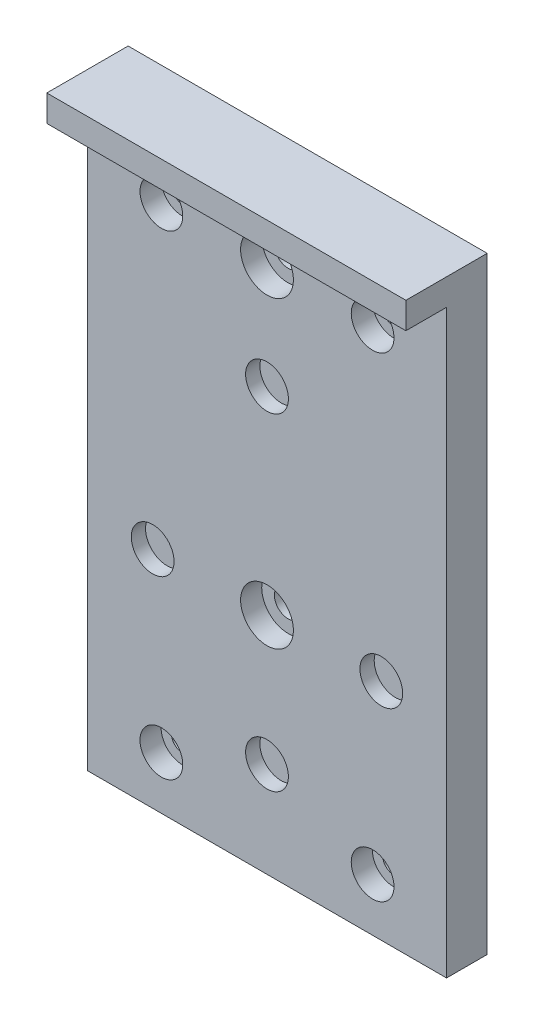
ISO-10303-21;
HEADER;
FILE_DESCRIPTION(('STEP AP214'),'2;1');
FILE_NAME('part.step','',(''),(''),'','','');
FILE_SCHEMA(('AUTOMOTIVE_DESIGN { 1 0 10303 214 1 1 1 1 }'));
ENDSEC;
DATA;
#1=APPLICATION_CONTEXT('core data for automotive mechanical design processes');
#2=APPLICATION_PROTOCOL_DEFINITION('international standard','automotive_design',2000,#1);
#3=PRODUCT_CONTEXT('',#1,'mechanical');
#4=PRODUCT('Part','Part','',(#3));
#5=PRODUCT_RELATED_PRODUCT_CATEGORY('part','',(#4));
#6=PRODUCT_DEFINITION_FORMATION('','',#4);
#7=PRODUCT_DEFINITION_CONTEXT('part definition',#1,'design');
#8=PRODUCT_DEFINITION('design','',#6,#7);
#9=PRODUCT_DEFINITION_SHAPE('','',#8);
#10=(LENGTH_UNIT() NAMED_UNIT(*) SI_UNIT(.MILLI.,.METRE.));
#11=(NAMED_UNIT(*) PLANE_ANGLE_UNIT() SI_UNIT($,.RADIAN.));
#12=(NAMED_UNIT(*) SI_UNIT($,.STERADIAN.) SOLID_ANGLE_UNIT());
#13=UNCERTAINTY_MEASURE_WITH_UNIT(LENGTH_MEASURE(1.E-05),#10,'distance_accuracy_value','');
#14=(GEOMETRIC_REPRESENTATION_CONTEXT(3) GLOBAL_UNCERTAINTY_ASSIGNED_CONTEXT((#13)) GLOBAL_UNIT_ASSIGNED_CONTEXT((#10,
#11,#12)) REPRESENTATION_CONTEXT('',''));
#15=CARTESIAN_POINT('',(0.,0.,0.));
#16=DIRECTION('',(0.,0.,1.));
#17=DIRECTION('',(1.,0.,0.));
#18=AXIS2_PLACEMENT_3D('',#15,#16,#17);
#19=CARTESIAN_POINT('',(0.,-36.95,7.7));
#20=DIRECTION('',(0.,0.,-1.));
#21=DIRECTION('',(-1.,0.,0.));
#22=AXIS2_PLACEMENT_3D('',#19,#20,#21);
#23=CYLINDRICAL_SURFACE('',#22,4.05);
#24=CARTESIAN_POINT('',(0.,-36.95,7.7));
#25=DIRECTION('',(0.,0.,1.));
#26=DIRECTION('',(1.,0.,0.));
#27=AXIS2_PLACEMENT_3D('',#24,#25,#26);
#28=CIRCLE('',#27,4.05);
#29=CARTESIAN_POINT('',(4.05,-36.95,7.7));
#30=VERTEX_POINT('',#29);
#31=EDGE_CURVE('E175',#30,#30,#28,.T.);
#32=ORIENTED_EDGE('',*,*,#31,.T.);
#33=EDGE_LOOP('',(#32));
#34=FACE_BOUND('',#33,.T.);
#35=CARTESIAN_POINT('',(0.,-36.95,5.));
#36=DIRECTION('',(0.,0.,-1.));
#37=DIRECTION('',(-1.,0.,0.));
#38=AXIS2_PLACEMENT_3D('',#35,#36,#37);
#39=CIRCLE('',#38,4.05);
#40=CARTESIAN_POINT('',(-4.05,-36.95,5.));
#41=VERTEX_POINT('',#40);
#42=EDGE_CURVE('E121',#41,#41,#39,.T.);
#43=ORIENTED_EDGE('',*,*,#42,.T.);
#44=EDGE_LOOP('',(#43));
#45=FACE_BOUND('',#44,.T.);
#46=ADVANCED_FACE('F33',(#34,#45),#23,.F.);
#47=CARTESIAN_POINT('',(-21.650635094611,-12.5,7.7));
#48=DIRECTION('',(0.,0.,-1.));
#49=DIRECTION('',(-1.,0.,0.));
#50=AXIS2_PLACEMENT_3D('',#47,#48,#49);
#51=CYLINDRICAL_SURFACE('',#50,4.05);
#52=CARTESIAN_POINT('',(-21.650635094611,-12.5,7.7));
#53=DIRECTION('',(0.,0.,1.));
#54=DIRECTION('',(1.,0.,0.));
#55=AXIS2_PLACEMENT_3D('',#52,#53,#54);
#56=CIRCLE('',#55,4.05);
#57=CARTESIAN_POINT('',(-17.600635094611,-12.5,7.7));
#58=VERTEX_POINT('',#57);
#59=EDGE_CURVE('E172',#58,#58,#56,.T.);
#60=ORIENTED_EDGE('',*,*,#59,.T.);
#61=EDGE_LOOP('',(#60));
#62=FACE_BOUND('',#61,.T.);
#63=CARTESIAN_POINT('',(-21.650635094611,-12.5,5.));
#64=DIRECTION('',(0.,0.,-1.));
#65=DIRECTION('',(-1.,0.,0.));
#66=AXIS2_PLACEMENT_3D('',#63,#64,#65);
#67=CIRCLE('',#66,4.05);
#68=CARTESIAN_POINT('',(-25.700635094611,-12.5,5.));
#69=VERTEX_POINT('',#68);
#70=EDGE_CURVE('E118',#69,#69,#67,.T.);
#71=ORIENTED_EDGE('',*,*,#70,.T.);
#72=EDGE_LOOP('',(#71));
#73=FACE_BOUND('',#72,.T.);
#74=ADVANCED_FACE('F264',(#62,#73),#51,.F.);
#75=CARTESIAN_POINT('',(0.,25.,7.7));
#76=DIRECTION('',(0.,0.,-1.));
#77=DIRECTION('',(-1.,0.,0.));
#78=AXIS2_PLACEMENT_3D('',#75,#76,#77);
#79=CYLINDRICAL_SURFACE('',#78,4.05);
#80=CARTESIAN_POINT('',(0.,25.,7.7));
#81=DIRECTION('',(0.,0.,1.));
#82=DIRECTION('',(1.,0.,0.));
#83=AXIS2_PLACEMENT_3D('',#80,#81,#82);
#84=CIRCLE('',#83,4.05);
#85=CARTESIAN_POINT('',(4.04999999999999,25.,7.7));
#86=VERTEX_POINT('',#85);
#87=EDGE_CURVE('E169',#86,#86,#84,.T.);
#88=ORIENTED_EDGE('',*,*,#87,.T.);
#89=EDGE_LOOP('',(#88));
#90=FACE_BOUND('',#89,.T.);
#91=CARTESIAN_POINT('',(0.,25.,5.));
#92=DIRECTION('',(0.,0.,-1.));
#93=DIRECTION('',(-1.,0.,0.));
#94=AXIS2_PLACEMENT_3D('',#91,#92,#93);
#95=CIRCLE('',#94,4.05);
#96=CARTESIAN_POINT('',(-4.05000000000001,25.,5.));
#97=VERTEX_POINT('',#96);
#98=EDGE_CURVE('E115',#97,#97,#95,.T.);
#99=ORIENTED_EDGE('',*,*,#98,.T.);
#100=EDGE_LOOP('',(#99));
#101=FACE_BOUND('',#100,.T.);
#102=ADVANCED_FACE('F270',(#90,#101),#79,.F.);
#103=CARTESIAN_POINT('',(21.650635094611,-12.5,7.7));
#104=DIRECTION('',(0.,0.,-1.));
#105=DIRECTION('',(-1.,0.,0.));
#106=AXIS2_PLACEMENT_3D('',#103,#104,#105);
#107=CYLINDRICAL_SURFACE('',#106,4.05);
#108=CARTESIAN_POINT('',(21.650635094611,-12.5,7.7));
#109=DIRECTION('',(0.,0.,1.));
#110=DIRECTION('',(1.,0.,0.));
#111=AXIS2_PLACEMENT_3D('',#108,#109,#110);
#112=CIRCLE('',#111,4.05);
#113=CARTESIAN_POINT('',(25.700635094611,-12.5,7.7));
#114=VERTEX_POINT('',#113);
#115=EDGE_CURVE('E166',#114,#114,#112,.T.);
#116=ORIENTED_EDGE('',*,*,#115,.T.);
#117=EDGE_LOOP('',(#116));
#118=FACE_BOUND('',#117,.T.);
#119=CARTESIAN_POINT('',(21.650635094611,-12.5,5.));
#120=DIRECTION('',(0.,0.,-1.));
#121=DIRECTION('',(-1.,0.,0.));
#122=AXIS2_PLACEMENT_3D('',#119,#120,#121);
#123=CIRCLE('',#122,4.05);
#124=CARTESIAN_POINT('',(17.600635094611,-12.5,5.));
#125=VERTEX_POINT('',#124);
#126=EDGE_CURVE('E111',#125,#125,#123,.T.);
#127=ORIENTED_EDGE('',*,*,#126,.T.);
#128=EDGE_LOOP('',(#127));
#129=FACE_BOUND('',#128,.T.);
#130=ADVANCED_FACE('F280',(#118,#129),#107,.F.);
#131=CARTESIAN_POINT('',(0.,0.,7.7));
#132=DIRECTION('',(0.,0.,1.));
#133=DIRECTION('',(1.,0.,0.));
#134=AXIS2_PLACEMENT_3D('',#131,#132,#133);
#135=PLANE('',#134);
#136=CARTESIAN_POINT('',(0.,45.,7.7));
#137=DIRECTION('',(0.,0.,-1.));
#138=DIRECTION('',(-1.,0.,0.));
#139=AXIS2_PLACEMENT_3D('',#136,#137,#138);
#140=CIRCLE('',#139,5.);
#141=CARTESIAN_POINT('',(-5.00000000000001,45.,7.7));
#142=VERTEX_POINT('',#141);
#143=EDGE_CURVE('E201',#142,#142,#140,.T.);
#144=ORIENTED_EDGE('',*,*,#143,.T.);
#145=EDGE_LOOP('',(#144));
#146=FACE_BOUND('',#145,.T.);
#147=CARTESIAN_POINT('',(-20.,-45.,7.7));
#148=DIRECTION('',(0.,0.,-1.));
#149=DIRECTION('',(-1.,0.,0.));
#150=AXIS2_PLACEMENT_3D('',#147,#148,#149);
#151=CIRCLE('',#150,4.05);
#152=CARTESIAN_POINT('',(-24.05,-45.,7.7));
#153=VERTEX_POINT('',#152);
#154=EDGE_CURVE('E208',#153,#153,#151,.T.);
#155=ORIENTED_EDGE('',*,*,#154,.T.);
#156=EDGE_LOOP('',(#155));
#157=FACE_BOUND('',#156,.T.);
#158=CARTESIAN_POINT('',(20.,-45.,7.7));
#159=DIRECTION('',(0.,0.,-1.));
#160=DIRECTION('',(-1.,0.,0.));
#161=AXIS2_PLACEMENT_3D('',#158,#159,#160);
#162=CIRCLE('',#161,4.05);
#163=CARTESIAN_POINT('',(15.95,-45.,7.7));
#164=VERTEX_POINT('',#163);
#165=EDGE_CURVE('E189',#164,#164,#162,.T.);
#166=ORIENTED_EDGE('',*,*,#165,.T.);
#167=EDGE_LOOP('',(#166));
#168=FACE_BOUND('',#167,.T.);
#169=CARTESIAN_POINT('',(-20.,45.,7.7));
#170=DIRECTION('',(0.,0.,-1.));
#171=DIRECTION('',(-1.,0.,0.));
#172=AXIS2_PLACEMENT_3D('',#169,#170,#171);
#173=CIRCLE('',#172,4.05);
#174=CARTESIAN_POINT('',(-24.05,45.,7.7));
#175=VERTEX_POINT('',#174);
#176=EDGE_CURVE('E196',#175,#175,#173,.T.);
#177=ORIENTED_EDGE('',*,*,#176,.T.);
#178=EDGE_LOOP('',(#177));
#179=FACE_BOUND('',#178,.T.);
#180=CARTESIAN_POINT('',(0.,-12.5,7.7));
#181=DIRECTION('',(0.,0.,-1.));
#182=DIRECTION('',(-1.,0.,0.));
#183=AXIS2_PLACEMENT_3D('',#180,#181,#182);
#184=CIRCLE('',#183,5.);
#185=CARTESIAN_POINT('',(-5.00000000000001,-12.5,7.7));
#186=VERTEX_POINT('',#185);
#187=EDGE_CURVE('E213',#186,#186,#184,.T.);
#188=ORIENTED_EDGE('',*,*,#187,.T.);
#189=EDGE_LOOP('',(#188));
#190=FACE_BOUND('',#189,.T.);
#191=CARTESIAN_POINT('',(20.,45.,7.7));
#192=DIRECTION('',(0.,0.,-1.));
#193=DIRECTION('',(-1.,0.,0.));
#194=AXIS2_PLACEMENT_3D('',#191,#192,#193);
#195=CIRCLE('',#194,4.05);
#196=CARTESIAN_POINT('',(15.95,45.,7.7));
#197=VERTEX_POINT('',#196);
#198=EDGE_CURVE('E183',#197,#197,#195,.T.);
#199=ORIENTED_EDGE('',*,*,#198,.T.);
#200=EDGE_LOOP('',(#199));
#201=FACE_BOUND('',#200,.T.);
#202=ORIENTED_EDGE('',*,*,#59,.F.);
#203=EDGE_LOOP('',(#202));
#204=FACE_BOUND('',#203,.T.);
#205=ORIENTED_EDGE('',*,*,#115,.F.);
#206=EDGE_LOOP('',(#205));
#207=FACE_BOUND('',#206,.T.);
#208=DIRECTION('',(0.,1.,0.));
#209=VECTOR('',#208,1.);
#210=CARTESIAN_POINT('',(34.,55.,7.7));
#211=LINE('',#210,#209);
#212=CARTESIAN_POINT('',(34.,-55.,7.7));
#213=VERTEX_POINT('',#212);
#214=CARTESIAN_POINT('',(34.,55.,7.7));
#215=VERTEX_POINT('',#214);
#216=EDGE_CURVE('E95',#213,#215,#211,.T.);
#217=ORIENTED_EDGE('',*,*,#216,.T.);
#218=DIRECTION('',(-1.,0.,0.));
#219=VECTOR('',#218,1.);
#220=CARTESIAN_POINT('',(-34.,55.,7.7));
#221=LINE('',#220,#219);
#222=CARTESIAN_POINT('',(-34.,55.,7.7));
#223=VERTEX_POINT('',#222);
#224=EDGE_CURVE('E73',#215,#223,#221,.T.);
#225=ORIENTED_EDGE('',*,*,#224,.T.);
#226=DIRECTION('',(0.,-1.,0.));
#227=VECTOR('',#226,1.);
#228=CARTESIAN_POINT('',(-34.,55.,7.7));
#229=LINE('',#228,#227);
#230=CARTESIAN_POINT('',(-34.,-55.,7.7));
#231=VERTEX_POINT('',#230);
#232=EDGE_CURVE('E93',#223,#231,#229,.T.);
#233=ORIENTED_EDGE('',*,*,#232,.T.);
#234=DIRECTION('',(1.,0.,0.));
#235=VECTOR('',#234,1.);
#236=CARTESIAN_POINT('',(-34.,-55.,7.7));
#237=LINE('',#236,#235);
#238=EDGE_CURVE('E52',#231,#213,#237,.T.);
#239=ORIENTED_EDGE('',*,*,#238,.T.);
#240=EDGE_LOOP('',(#217,#225,#233,#239));
#241=FACE_BOUND('',#240,.T.);
#242=ORIENTED_EDGE('',*,*,#87,.F.);
#243=EDGE_LOOP('',(#242));
#244=FACE_BOUND('',#243,.T.);
#245=ORIENTED_EDGE('',*,*,#31,.F.);
#246=EDGE_LOOP('',(#245));
#247=FACE_BOUND('',#246,.T.);
#248=ADVANCED_FACE('F91',(#146,#157,#168,#179,#190,#201,#204,#207,#241,#244,#247),#135,.T.);
#249=CARTESIAN_POINT('',(0.,0.,0.));
#250=DIRECTION('',(0.,0.,1.));
#251=DIRECTION('',(1.,0.,0.));
#252=AXIS2_PLACEMENT_3D('',#249,#250,#251);
#253=PLANE('',#252);
#254=DIRECTION('',(0.,1.,0.));
#255=VECTOR('',#254,1.);
#256=CARTESIAN_POINT('',(34.,55.,0.));
#257=LINE('',#256,#255);
#258=CARTESIAN_POINT('',(34.,-55.,0.));
#259=VERTEX_POINT('',#258);
#260=CARTESIAN_POINT('',(34.,60.,0.));
#261=VERTEX_POINT('',#260);
#262=EDGE_CURVE('E102',#259,#261,#257,.T.);
#263=ORIENTED_EDGE('',*,*,#262,.F.);
#264=DIRECTION('',(1.,0.,0.));
#265=VECTOR('',#264,1.);
#266=CARTESIAN_POINT('',(-34.,-55.,0.));
#267=LINE('',#266,#265);
#268=CARTESIAN_POINT('',(-34.,-55.,0.));
#269=VERTEX_POINT('',#268);
#270=EDGE_CURVE('E107',#269,#259,#267,.T.);
#271=ORIENTED_EDGE('',*,*,#270,.F.);
#272=DIRECTION('',(0.,-1.,0.));
#273=VECTOR('',#272,1.);
#274=CARTESIAN_POINT('',(-34.,55.,0.));
#275=LINE('',#274,#273);
#276=CARTESIAN_POINT('',(-34.,60.,0.));
#277=VERTEX_POINT('',#276);
#278=EDGE_CURVE('E64',#277,#269,#275,.T.);
#279=ORIENTED_EDGE('',*,*,#278,.F.);
#280=DIRECTION('',(-1.,0.,0.));
#281=VECTOR('',#280,1.);
#282=CARTESIAN_POINT('',(34.,60.,0.));
#283=LINE('',#282,#281);
#284=EDGE_CURVE('E89',#261,#277,#283,.T.);
#285=ORIENTED_EDGE('',*,*,#284,.F.);
#286=EDGE_LOOP('',(#263,#271,#279,#285));
#287=FACE_BOUND('',#286,.T.);
#288=CARTESIAN_POINT('',(20.,45.,0.));
#289=DIRECTION('',(0.,0.,1.));
#290=DIRECTION('',(1.,0.,0.));
#291=AXIS2_PLACEMENT_3D('',#288,#289,#290);
#292=CIRCLE('',#291,2.1);
#293=CARTESIAN_POINT('',(22.1,45.,0.));
#294=VERTEX_POINT('',#293);
#295=EDGE_CURVE('E105',#294,#294,#292,.T.);
#296=ORIENTED_EDGE('',*,*,#295,.T.);
#297=EDGE_LOOP('',(#296));
#298=FACE_BOUND('',#297,.T.);
#299=CARTESIAN_POINT('',(-20.,45.,0.));
#300=DIRECTION('',(0.,0.,1.));
#301=DIRECTION('',(1.,0.,0.));
#302=AXIS2_PLACEMENT_3D('',#299,#300,#301);
#303=CIRCLE('',#302,2.1);
#304=CARTESIAN_POINT('',(-17.9,45.,0.));
#305=VERTEX_POINT('',#304);
#306=EDGE_CURVE('E155',#305,#305,#303,.T.);
#307=ORIENTED_EDGE('',*,*,#306,.T.);
#308=EDGE_LOOP('',(#307));
#309=FACE_BOUND('',#308,.T.);
#310=CARTESIAN_POINT('',(20.,-45.,0.));
#311=DIRECTION('',(0.,0.,1.));
#312=DIRECTION('',(1.,0.,0.));
#313=AXIS2_PLACEMENT_3D('',#310,#311,#312);
#314=CIRCLE('',#313,2.1);
#315=CARTESIAN_POINT('',(22.1,-45.,0.));
#316=VERTEX_POINT('',#315);
#317=EDGE_CURVE('E158',#316,#316,#314,.T.);
#318=ORIENTED_EDGE('',*,*,#317,.T.);
#319=EDGE_LOOP('',(#318));
#320=FACE_BOUND('',#319,.T.);
#321=CARTESIAN_POINT('',(-20.,-45.,0.));
#322=DIRECTION('',(0.,0.,1.));
#323=DIRECTION('',(1.,0.,0.));
#324=AXIS2_PLACEMENT_3D('',#321,#322,#323);
#325=CIRCLE('',#324,2.1);
#326=CARTESIAN_POINT('',(-17.9,-45.,0.));
#327=VERTEX_POINT('',#326);
#328=EDGE_CURVE('E163',#327,#327,#325,.T.);
#329=ORIENTED_EDGE('',*,*,#328,.T.);
#330=EDGE_LOOP('',(#329));
#331=FACE_BOUND('',#330,.T.);
#332=CARTESIAN_POINT('',(0.,45.,0.));
#333=DIRECTION('',(0.,0.,1.));
#334=DIRECTION('',(1.,0.,0.));
#335=AXIS2_PLACEMENT_3D('',#332,#333,#334);
#336=CIRCLE('',#335,2.6);
#337=CARTESIAN_POINT('',(2.59999999999999,45.,0.));
#338=VERTEX_POINT('',#337);
#339=EDGE_CURVE('E178',#338,#338,#336,.T.);
#340=ORIENTED_EDGE('',*,*,#339,.T.);
#341=EDGE_LOOP('',(#340));
#342=FACE_BOUND('',#341,.T.);
#343=CARTESIAN_POINT('',(0.,-12.5,0.));
#344=DIRECTION('',(0.,0.,1.));
#345=DIRECTION('',(1.,0.,0.));
#346=AXIS2_PLACEMENT_3D('',#343,#344,#345);
#347=CIRCLE('',#346,2.6);
#348=CARTESIAN_POINT('',(2.59999999999999,-12.5,0.));
#349=VERTEX_POINT('',#348);
#350=EDGE_CURVE('E114',#349,#349,#347,.T.);
#351=ORIENTED_EDGE('',*,*,#350,.T.);
#352=EDGE_LOOP('',(#351));
#353=FACE_BOUND('',#352,.T.);
#354=ADVANCED_FACE('F253',(#287,#298,#309,#320,#331,#342,#353),#253,.F.);
#355=CARTESIAN_POINT('',(34.,55.,7.7));
#356=DIRECTION('',(-1.,0.,0.));
#357=DIRECTION('',(0.,-1.,0.));
#358=AXIS2_PLACEMENT_3D('',#355,#356,#357);
#359=PLANE('',#358);
#360=ORIENTED_EDGE('',*,*,#262,.T.);
#361=DIRECTION('',(0.,0.,1.));
#362=VECTOR('',#361,1.);
#363=CARTESIAN_POINT('',(34.,60.,0.));
#364=LINE('',#363,#362);
#365=CARTESIAN_POINT('',(34.,60.,15.4));
#366=VERTEX_POINT('',#365);
#367=EDGE_CURVE('E220',#261,#366,#364,.T.);
#368=ORIENTED_EDGE('',*,*,#367,.T.);
#369=DIRECTION('',(0.,1.,0.));
#370=VECTOR('',#369,1.);
#371=CARTESIAN_POINT('',(34.,55.,15.4));
#372=LINE('',#371,#370);
#373=CARTESIAN_POINT('',(34.,55.,15.4));
#374=VERTEX_POINT('',#373);
#375=EDGE_CURVE('E230',#374,#366,#372,.T.);
#376=ORIENTED_EDGE('',*,*,#375,.F.);
#377=DIRECTION('',(0.,0.,1.));
#378=VECTOR('',#377,1.);
#379=CARTESIAN_POINT('',(34.,55.,0.));
#380=LINE('',#379,#378);
#381=EDGE_CURVE('E88',#215,#374,#380,.T.);
#382=ORIENTED_EDGE('',*,*,#381,.F.);
#383=ORIENTED_EDGE('',*,*,#216,.F.);
#384=DIRECTION('',(0.,0.,-1.));
#385=VECTOR('',#384,1.);
#386=CARTESIAN_POINT('',(34.,-55.,7.7));
#387=LINE('',#386,#385);
#388=EDGE_CURVE('E43',#213,#259,#387,.T.);
#389=ORIENTED_EDGE('',*,*,#388,.T.);
#390=EDGE_LOOP('',(#360,#368,#376,#382,#383,#389));
#391=FACE_BOUND('',#390,.T.);
#392=ADVANCED_FACE('F35',(#391),#359,.F.);
#393=CARTESIAN_POINT('',(-34.,55.,7.7));
#394=DIRECTION('',(1.,0.,0.));
#395=DIRECTION('',(0.,1.,0.));
#396=AXIS2_PLACEMENT_3D('',#393,#394,#395);
#397=PLANE('',#396);
#398=ORIENTED_EDGE('',*,*,#278,.T.);
#399=DIRECTION('',(0.,0.,-1.));
#400=VECTOR('',#399,1.);
#401=CARTESIAN_POINT('',(-34.,-55.,7.7));
#402=LINE('',#401,#400);
#403=EDGE_CURVE('E11',#231,#269,#402,.T.);
#404=ORIENTED_EDGE('',*,*,#403,.F.);
#405=ORIENTED_EDGE('',*,*,#232,.F.);
#406=DIRECTION('',(0.,0.,1.));
#407=VECTOR('',#406,1.);
#408=CARTESIAN_POINT('',(-34.,55.,0.));
#409=LINE('',#408,#407);
#410=CARTESIAN_POINT('',(-34.,55.,15.4));
#411=VERTEX_POINT('',#410);
#412=EDGE_CURVE('E80',#223,#411,#409,.T.);
#413=ORIENTED_EDGE('',*,*,#412,.T.);
#414=DIRECTION('',(0.,-1.,0.));
#415=VECTOR('',#414,1.);
#416=CARTESIAN_POINT('',(-34.,60.,15.4));
#417=LINE('',#416,#415);
#418=CARTESIAN_POINT('',(-34.,60.,15.4));
#419=VERTEX_POINT('',#418);
#420=EDGE_CURVE('E234',#419,#411,#417,.T.);
#421=ORIENTED_EDGE('',*,*,#420,.F.);
#422=DIRECTION('',(0.,0.,1.));
#423=VECTOR('',#422,1.);
#424=CARTESIAN_POINT('',(-34.,60.,0.));
#425=LINE('',#424,#423);
#426=EDGE_CURVE('E216',#277,#419,#425,.T.);
#427=ORIENTED_EDGE('',*,*,#426,.F.);
#428=EDGE_LOOP('',(#398,#404,#405,#413,#421,#427));
#429=FACE_BOUND('',#428,.T.);
#430=ADVANCED_FACE('F97',(#429),#397,.F.);
#431=CARTESIAN_POINT('',(-34.,-55.,7.7));
#432=DIRECTION('',(0.,1.,0.));
#433=DIRECTION('',(0.,0.,1.));
#434=AXIS2_PLACEMENT_3D('',#431,#432,#433);
#435=PLANE('',#434);
#436=ORIENTED_EDGE('',*,*,#270,.T.);
#437=ORIENTED_EDGE('',*,*,#388,.F.);
#438=ORIENTED_EDGE('',*,*,#238,.F.);
#439=ORIENTED_EDGE('',*,*,#403,.T.);
#440=EDGE_LOOP('',(#436,#437,#438,#439));
#441=FACE_BOUND('',#440,.T.);
#442=ADVANCED_FACE('F150',(#441),#435,.F.);
#443=CARTESIAN_POINT('',(20.,45.,7.7));
#444=DIRECTION('',(0.,0.,-1.));
#445=DIRECTION('',(-1.,0.,0.));
#446=AXIS2_PLACEMENT_3D('',#443,#444,#445);
#447=CYLINDRICAL_SURFACE('',#446,2.1);
#448=CARTESIAN_POINT('',(20.,45.,3.7));
#449=DIRECTION('',(0.,0.,-1.));
#450=DIRECTION('',(-1.,0.,0.));
#451=AXIS2_PLACEMENT_3D('',#448,#449,#450);
#452=CIRCLE('',#451,2.1);
#453=CARTESIAN_POINT('',(17.9,45.,3.7));
#454=VERTEX_POINT('',#453);
#455=EDGE_CURVE('E37',#454,#454,#452,.T.);
#456=ORIENTED_EDGE('',*,*,#455,.F.);
#457=EDGE_LOOP('',(#456));
#458=FACE_BOUND('',#457,.T.);
#459=ORIENTED_EDGE('',*,*,#295,.F.);
#460=EDGE_LOOP('',(#459));
#461=FACE_BOUND('',#460,.T.);
#462=ADVANCED_FACE('F146',(#458,#461),#447,.F.);
#463=CARTESIAN_POINT('',(-20.,45.,7.7));
#464=DIRECTION('',(0.,0.,-1.));
#465=DIRECTION('',(-1.,0.,0.));
#466=AXIS2_PLACEMENT_3D('',#463,#464,#465);
#467=CYLINDRICAL_SURFACE('',#466,2.1);
#468=CARTESIAN_POINT('',(-20.,45.,3.7));
#469=DIRECTION('',(0.,0.,-1.));
#470=DIRECTION('',(-1.,0.,0.));
#471=AXIS2_PLACEMENT_3D('',#468,#469,#470);
#472=CIRCLE('',#471,2.1);
#473=CARTESIAN_POINT('',(-22.1,45.,3.7));
#474=VERTEX_POINT('',#473);
#475=EDGE_CURVE('E136',#474,#474,#472,.T.);
#476=ORIENTED_EDGE('',*,*,#475,.F.);
#477=EDGE_LOOP('',(#476));
#478=FACE_BOUND('',#477,.T.);
#479=ORIENTED_EDGE('',*,*,#306,.F.);
#480=EDGE_LOOP('',(#479));
#481=FACE_BOUND('',#480,.T.);
#482=ADVANCED_FACE('F149',(#478,#481),#467,.F.);
#483=CARTESIAN_POINT('',(20.,-45.,7.7));
#484=DIRECTION('',(0.,0.,-1.));
#485=DIRECTION('',(-1.,0.,0.));
#486=AXIS2_PLACEMENT_3D('',#483,#484,#485);
#487=CYLINDRICAL_SURFACE('',#486,2.1);
#488=CARTESIAN_POINT('',(20.,-45.,3.7));
#489=DIRECTION('',(0.,0.,-1.));
#490=DIRECTION('',(-1.,0.,0.));
#491=AXIS2_PLACEMENT_3D('',#488,#489,#490);
#492=CIRCLE('',#491,2.1);
#493=CARTESIAN_POINT('',(17.9,-45.,3.7));
#494=VERTEX_POINT('',#493);
#495=EDGE_CURVE('E134',#494,#494,#492,.T.);
#496=ORIENTED_EDGE('',*,*,#495,.F.);
#497=EDGE_LOOP('',(#496));
#498=FACE_BOUND('',#497,.T.);
#499=ORIENTED_EDGE('',*,*,#317,.F.);
#500=EDGE_LOOP('',(#499));
#501=FACE_BOUND('',#500,.T.);
#502=ADVANCED_FACE('F288',(#498,#501),#487,.F.);
#503=CARTESIAN_POINT('',(-20.,-45.,7.7));
#504=DIRECTION('',(0.,0.,-1.));
#505=DIRECTION('',(-1.,0.,0.));
#506=AXIS2_PLACEMENT_3D('',#503,#504,#505);
#507=CYLINDRICAL_SURFACE('',#506,2.1);
#508=CARTESIAN_POINT('',(-20.,-45.,3.7));
#509=DIRECTION('',(0.,0.,-1.));
#510=DIRECTION('',(-1.,0.,0.));
#511=AXIS2_PLACEMENT_3D('',#508,#509,#510);
#512=CIRCLE('',#511,2.1);
#513=CARTESIAN_POINT('',(-22.1,-45.,3.7));
#514=VERTEX_POINT('',#513);
#515=EDGE_CURVE('E131',#514,#514,#512,.T.);
#516=ORIENTED_EDGE('',*,*,#515,.F.);
#517=EDGE_LOOP('',(#516));
#518=FACE_BOUND('',#517,.T.);
#519=ORIENTED_EDGE('',*,*,#328,.F.);
#520=EDGE_LOOP('',(#519));
#521=FACE_BOUND('',#520,.T.);
#522=ADVANCED_FACE('F285',(#518,#521),#507,.F.);
#523=CARTESIAN_POINT('',(0.,45.,7.7));
#524=DIRECTION('',(0.,0.,-1.));
#525=DIRECTION('',(-1.,0.,0.));
#526=AXIS2_PLACEMENT_3D('',#523,#524,#525);
#527=CYLINDRICAL_SURFACE('',#526,2.6);
#528=CARTESIAN_POINT('',(0.,45.,3.7));
#529=DIRECTION('',(0.,0.,-1.));
#530=DIRECTION('',(-1.,0.,0.));
#531=AXIS2_PLACEMENT_3D('',#528,#529,#530);
#532=CIRCLE('',#531,2.6);
#533=CARTESIAN_POINT('',(-2.60000000000001,45.,3.7));
#534=VERTEX_POINT('',#533);
#535=EDGE_CURVE('E127',#534,#534,#532,.T.);
#536=ORIENTED_EDGE('',*,*,#535,.F.);
#537=EDGE_LOOP('',(#536));
#538=FACE_BOUND('',#537,.T.);
#539=ORIENTED_EDGE('',*,*,#339,.F.);
#540=EDGE_LOOP('',(#539));
#541=FACE_BOUND('',#540,.T.);
#542=ADVANCED_FACE('F275',(#538,#541),#527,.F.);
#543=CARTESIAN_POINT('',(0.,-12.5,7.7));
#544=DIRECTION('',(0.,0.,-1.));
#545=DIRECTION('',(-1.,0.,0.));
#546=AXIS2_PLACEMENT_3D('',#543,#544,#545);
#547=CYLINDRICAL_SURFACE('',#546,2.6);
#548=CARTESIAN_POINT('',(0.,-12.5,3.7));
#549=DIRECTION('',(0.,0.,-1.));
#550=DIRECTION('',(-1.,0.,0.));
#551=AXIS2_PLACEMENT_3D('',#548,#549,#550);
#552=CIRCLE('',#551,2.6);
#553=CARTESIAN_POINT('',(-2.60000000000001,-12.5,3.7));
#554=VERTEX_POINT('',#553);
#555=EDGE_CURVE('E124',#554,#554,#552,.T.);
#556=ORIENTED_EDGE('',*,*,#555,.F.);
#557=EDGE_LOOP('',(#556));
#558=FACE_BOUND('',#557,.T.);
#559=ORIENTED_EDGE('',*,*,#350,.F.);
#560=EDGE_LOOP('',(#559));
#561=FACE_BOUND('',#560,.T.);
#562=ADVANCED_FACE('F494',(#558,#561),#547,.F.);
#563=CARTESIAN_POINT('',(21.650635094611,-12.5,5.));
#564=DIRECTION('',(0.,0.,-1.));
#565=DIRECTION('',(-1.,0.,0.));
#566=AXIS2_PLACEMENT_3D('',#563,#564,#565);
#567=PLANE('',#566);
#568=ORIENTED_EDGE('',*,*,#126,.F.);
#569=EDGE_LOOP('',(#568));
#570=FACE_BOUND('',#569,.T.);
#571=ADVANCED_FACE('F486',(#570),#567,.F.);
#572=CARTESIAN_POINT('',(0.,25.,5.));
#573=DIRECTION('',(0.,0.,-1.));
#574=DIRECTION('',(-1.,0.,0.));
#575=AXIS2_PLACEMENT_3D('',#572,#573,#574);
#576=PLANE('',#575);
#577=ORIENTED_EDGE('',*,*,#98,.F.);
#578=EDGE_LOOP('',(#577));
#579=FACE_BOUND('',#578,.T.);
#580=ADVANCED_FACE('F478',(#579),#576,.F.);
#581=CARTESIAN_POINT('',(-21.650635094611,-12.5,5.));
#582=DIRECTION('',(0.,0.,-1.));
#583=DIRECTION('',(-1.,0.,0.));
#584=AXIS2_PLACEMENT_3D('',#581,#582,#583);
#585=PLANE('',#584);
#586=ORIENTED_EDGE('',*,*,#70,.F.);
#587=EDGE_LOOP('',(#586));
#588=FACE_BOUND('',#587,.T.);
#589=ADVANCED_FACE('F468',(#588),#585,.F.);
#590=CARTESIAN_POINT('',(0.,-36.95,5.));
#591=DIRECTION('',(0.,0.,-1.));
#592=DIRECTION('',(-1.,0.,0.));
#593=AXIS2_PLACEMENT_3D('',#590,#591,#592);
#594=PLANE('',#593);
#595=ORIENTED_EDGE('',*,*,#42,.F.);
#596=EDGE_LOOP('',(#595));
#597=FACE_BOUND('',#596,.T.);
#598=ADVANCED_FACE('F458',(#597),#594,.F.);
#599=CARTESIAN_POINT('',(0.,-12.5,3.7));
#600=DIRECTION('',(0.,0.,1.));
#601=DIRECTION('',(1.,0.,0.));
#602=AXIS2_PLACEMENT_3D('',#599,#600,#601);
#603=CYLINDRICAL_SURFACE('',#602,5.);
#604=CARTESIAN_POINT('',(0.,-12.5,3.7));
#605=DIRECTION('',(0.,0.,-1.));
#606=DIRECTION('',(-1.,0.,0.));
#607=AXIS2_PLACEMENT_3D('',#604,#605,#606);
#608=CIRCLE('',#607,5.);
#609=CARTESIAN_POINT('',(-5.00000000000001,-12.5,3.7));
#610=VERTEX_POINT('',#609);
#611=EDGE_CURVE('E205',#610,#610,#608,.T.);
#612=ORIENTED_EDGE('',*,*,#611,.T.);
#613=EDGE_LOOP('',(#612));
#614=FACE_BOUND('',#613,.T.);
#615=ORIENTED_EDGE('',*,*,#187,.F.);
#616=EDGE_LOOP('',(#615));
#617=FACE_BOUND('',#616,.T.);
#618=ADVANCED_FACE('F449',(#614,#617),#603,.F.);
#619=CARTESIAN_POINT('',(0.,-12.5,3.7));
#620=DIRECTION('',(0.,0.,-1.));
#621=DIRECTION('',(-1.,0.,0.));
#622=AXIS2_PLACEMENT_3D('',#619,#620,#621);
#623=PLANE('',#622);
#624=ORIENTED_EDGE('',*,*,#555,.T.);
#625=EDGE_LOOP('',(#624));
#626=FACE_BOUND('',#625,.T.);
#627=ORIENTED_EDGE('',*,*,#611,.F.);
#628=EDGE_LOOP('',(#627));
#629=FACE_BOUND('',#628,.T.);
#630=ADVANCED_FACE('F440',(#626,#629),#623,.F.);
#631=CARTESIAN_POINT('',(0.,45.,3.7));
#632=DIRECTION('',(0.,0.,1.));
#633=DIRECTION('',(1.,0.,0.));
#634=AXIS2_PLACEMENT_3D('',#631,#632,#633);
#635=CYLINDRICAL_SURFACE('',#634,5.);
#636=CARTESIAN_POINT('',(0.,45.,3.7));
#637=DIRECTION('',(0.,0.,-1.));
#638=DIRECTION('',(-1.,0.,0.));
#639=AXIS2_PLACEMENT_3D('',#636,#637,#638);
#640=CIRCLE('',#639,5.);
#641=CARTESIAN_POINT('',(-5.00000000000001,45.,3.7));
#642=VERTEX_POINT('',#641);
#643=EDGE_CURVE('E204',#642,#642,#640,.T.);
#644=ORIENTED_EDGE('',*,*,#643,.T.);
#645=EDGE_LOOP('',(#644));
#646=FACE_BOUND('',#645,.T.);
#647=ORIENTED_EDGE('',*,*,#143,.F.);
#648=EDGE_LOOP('',(#647));
#649=FACE_BOUND('',#648,.T.);
#650=ADVANCED_FACE('F431',(#646,#649),#635,.F.);
#651=CARTESIAN_POINT('',(0.,45.,3.7));
#652=DIRECTION('',(0.,0.,-1.));
#653=DIRECTION('',(-1.,0.,0.));
#654=AXIS2_PLACEMENT_3D('',#651,#652,#653);
#655=PLANE('',#654);
#656=ORIENTED_EDGE('',*,*,#535,.T.);
#657=EDGE_LOOP('',(#656));
#658=FACE_BOUND('',#657,.T.);
#659=ORIENTED_EDGE('',*,*,#643,.F.);
#660=EDGE_LOOP('',(#659));
#661=FACE_BOUND('',#660,.T.);
#662=ADVANCED_FACE('F422',(#658,#661),#655,.F.);
#663=CARTESIAN_POINT('',(-20.,-45.,3.7));
#664=DIRECTION('',(0.,0.,1.));
#665=DIRECTION('',(1.,0.,0.));
#666=AXIS2_PLACEMENT_3D('',#663,#664,#665);
#667=CYLINDRICAL_SURFACE('',#666,4.05);
#668=CARTESIAN_POINT('',(-20.,-45.,3.7));
#669=DIRECTION('',(0.,0.,-1.));
#670=DIRECTION('',(-1.,0.,0.));
#671=AXIS2_PLACEMENT_3D('',#668,#669,#670);
#672=CIRCLE('',#671,4.05);
#673=CARTESIAN_POINT('',(-24.05,-45.,3.7));
#674=VERTEX_POINT('',#673);
#675=EDGE_CURVE('E193',#674,#674,#672,.T.);
#676=ORIENTED_EDGE('',*,*,#675,.T.);
#677=EDGE_LOOP('',(#676));
#678=FACE_BOUND('',#677,.T.);
#679=ORIENTED_EDGE('',*,*,#154,.F.);
#680=EDGE_LOOP('',(#679));
#681=FACE_BOUND('',#680,.T.);
#682=ADVANCED_FACE('F413',(#678,#681),#667,.F.);
#683=CARTESIAN_POINT('',(-20.,-45.,3.7));
#684=DIRECTION('',(0.,0.,-1.));
#685=DIRECTION('',(-1.,0.,0.));
#686=AXIS2_PLACEMENT_3D('',#683,#684,#685);
#687=PLANE('',#686);
#688=ORIENTED_EDGE('',*,*,#515,.T.);
#689=EDGE_LOOP('',(#688));
#690=FACE_BOUND('',#689,.T.);
#691=ORIENTED_EDGE('',*,*,#675,.F.);
#692=EDGE_LOOP('',(#691));
#693=FACE_BOUND('',#692,.T.);
#694=ADVANCED_FACE('F404',(#690,#693),#687,.F.);
#695=CARTESIAN_POINT('',(20.,-45.,3.7));
#696=DIRECTION('',(0.,0.,1.));
#697=DIRECTION('',(1.,0.,0.));
#698=AXIS2_PLACEMENT_3D('',#695,#696,#697);
#699=CYLINDRICAL_SURFACE('',#698,4.05);
#700=CARTESIAN_POINT('',(20.,-45.,3.7));
#701=DIRECTION('',(0.,0.,-1.));
#702=DIRECTION('',(-1.,0.,0.));
#703=AXIS2_PLACEMENT_3D('',#700,#701,#702);
#704=CIRCLE('',#703,4.05);
#705=CARTESIAN_POINT('',(15.95,-45.,3.7));
#706=VERTEX_POINT('',#705);
#707=EDGE_CURVE('E192',#706,#706,#704,.T.);
#708=ORIENTED_EDGE('',*,*,#707,.T.);
#709=EDGE_LOOP('',(#708));
#710=FACE_BOUND('',#709,.T.);
#711=ORIENTED_EDGE('',*,*,#165,.F.);
#712=EDGE_LOOP('',(#711));
#713=FACE_BOUND('',#712,.T.);
#714=ADVANCED_FACE('F395',(#710,#713),#699,.F.);
#715=CARTESIAN_POINT('',(20.,-45.,3.7));
#716=DIRECTION('',(0.,0.,-1.));
#717=DIRECTION('',(-1.,0.,0.));
#718=AXIS2_PLACEMENT_3D('',#715,#716,#717);
#719=PLANE('',#718);
#720=ORIENTED_EDGE('',*,*,#495,.T.);
#721=EDGE_LOOP('',(#720));
#722=FACE_BOUND('',#721,.T.);
#723=ORIENTED_EDGE('',*,*,#707,.F.);
#724=EDGE_LOOP('',(#723));
#725=FACE_BOUND('',#724,.T.);
#726=ADVANCED_FACE('F386',(#722,#725),#719,.F.);
#727=CARTESIAN_POINT('',(-20.,45.,3.7));
#728=DIRECTION('',(0.,0.,1.));
#729=DIRECTION('',(1.,0.,0.));
#730=AXIS2_PLACEMENT_3D('',#727,#728,#729);
#731=CYLINDRICAL_SURFACE('',#730,4.05);
#732=CARTESIAN_POINT('',(-20.,45.,3.7));
#733=DIRECTION('',(0.,0.,-1.));
#734=DIRECTION('',(-1.,0.,0.));
#735=AXIS2_PLACEMENT_3D('',#732,#733,#734);
#736=CIRCLE('',#735,4.05);
#737=CARTESIAN_POINT('',(-24.05,45.,3.7));
#738=VERTEX_POINT('',#737);
#739=EDGE_CURVE('E186',#738,#738,#736,.T.);
#740=ORIENTED_EDGE('',*,*,#739,.T.);
#741=EDGE_LOOP('',(#740));
#742=FACE_BOUND('',#741,.T.);
#743=ORIENTED_EDGE('',*,*,#176,.F.);
#744=EDGE_LOOP('',(#743));
#745=FACE_BOUND('',#744,.T.);
#746=ADVANCED_FACE('F378',(#742,#745),#731,.F.);
#747=CARTESIAN_POINT('',(-20.,45.,3.7));
#748=DIRECTION('',(0.,0.,-1.));
#749=DIRECTION('',(-1.,0.,0.));
#750=AXIS2_PLACEMENT_3D('',#747,#748,#749);
#751=PLANE('',#750);
#752=ORIENTED_EDGE('',*,*,#475,.T.);
#753=EDGE_LOOP('',(#752));
#754=FACE_BOUND('',#753,.T.);
#755=ORIENTED_EDGE('',*,*,#739,.F.);
#756=EDGE_LOOP('',(#755));
#757=FACE_BOUND('',#756,.T.);
#758=ADVANCED_FACE('F369',(#754,#757),#751,.F.);
#759=CARTESIAN_POINT('',(20.,45.,3.7));
#760=DIRECTION('',(0.,0.,1.));
#761=DIRECTION('',(1.,0.,0.));
#762=AXIS2_PLACEMENT_3D('',#759,#760,#761);
#763=CYLINDRICAL_SURFACE('',#762,4.05);
#764=CARTESIAN_POINT('',(20.,45.,3.7));
#765=DIRECTION('',(0.,0.,-1.));
#766=DIRECTION('',(-1.,0.,0.));
#767=AXIS2_PLACEMENT_3D('',#764,#765,#766);
#768=CIRCLE('',#767,4.05);
#769=CARTESIAN_POINT('',(15.95,45.,3.7));
#770=VERTEX_POINT('',#769);
#771=EDGE_CURVE('E128',#770,#770,#768,.T.);
#772=ORIENTED_EDGE('',*,*,#771,.T.);
#773=EDGE_LOOP('',(#772));
#774=FACE_BOUND('',#773,.T.);
#775=ORIENTED_EDGE('',*,*,#198,.F.);
#776=EDGE_LOOP('',(#775));
#777=FACE_BOUND('',#776,.T.);
#778=ADVANCED_FACE('F361',(#774,#777),#763,.F.);
#779=CARTESIAN_POINT('',(20.,45.,3.7));
#780=DIRECTION('',(0.,0.,-1.));
#781=DIRECTION('',(-1.,0.,0.));
#782=AXIS2_PLACEMENT_3D('',#779,#780,#781);
#783=PLANE('',#782);
#784=ORIENTED_EDGE('',*,*,#455,.T.);
#785=EDGE_LOOP('',(#784));
#786=FACE_BOUND('',#785,.T.);
#787=ORIENTED_EDGE('',*,*,#771,.F.);
#788=EDGE_LOOP('',(#787));
#789=FACE_BOUND('',#788,.T.);
#790=ADVANCED_FACE('F143',(#786,#789),#783,.F.);
#791=CARTESIAN_POINT('',(-34.,55.,0.));
#792=DIRECTION('',(0.,-1.,0.));
#793=DIRECTION('',(0.,0.,-1.));
#794=AXIS2_PLACEMENT_3D('',#791,#792,#793);
#795=PLANE('',#794);
#796=ORIENTED_EDGE('',*,*,#224,.F.);
#797=ORIENTED_EDGE('',*,*,#381,.T.);
#798=DIRECTION('',(1.,0.,0.));
#799=VECTOR('',#798,1.);
#800=CARTESIAN_POINT('',(-34.,55.,15.4));
#801=LINE('',#800,#799);
#802=EDGE_CURVE('E84',#411,#374,#801,.T.);
#803=ORIENTED_EDGE('',*,*,#802,.F.);
#804=ORIENTED_EDGE('',*,*,#412,.F.);
#805=EDGE_LOOP('',(#796,#797,#803,#804));
#806=FACE_BOUND('',#805,.T.);
#807=ADVANCED_FACE('F81',(#806),#795,.T.);
#808=CARTESIAN_POINT('',(34.,60.,0.));
#809=DIRECTION('',(0.,1.,0.));
#810=DIRECTION('',(0.,0.,1.));
#811=AXIS2_PLACEMENT_3D('',#808,#809,#810);
#812=PLANE('',#811);
#813=ORIENTED_EDGE('',*,*,#426,.T.);
#814=DIRECTION('',(-1.,0.,0.));
#815=VECTOR('',#814,1.);
#816=CARTESIAN_POINT('',(34.,60.,15.4));
#817=LINE('',#816,#815);
#818=EDGE_CURVE('E227',#366,#419,#817,.T.);
#819=ORIENTED_EDGE('',*,*,#818,.F.);
#820=ORIENTED_EDGE('',*,*,#367,.F.);
#821=ORIENTED_EDGE('',*,*,#284,.T.);
#822=EDGE_LOOP('',(#813,#819,#820,#821));
#823=FACE_BOUND('',#822,.T.);
#824=ADVANCED_FACE('F249',(#823),#812,.T.);
#825=CARTESIAN_POINT('',(0.,0.,15.4));
#826=DIRECTION('',(0.,0.,1.));
#827=DIRECTION('',(1.,0.,0.));
#828=AXIS2_PLACEMENT_3D('',#825,#826,#827);
#829=PLANE('',#828);
#830=ORIENTED_EDGE('',*,*,#420,.T.);
#831=ORIENTED_EDGE('',*,*,#802,.T.);
#832=ORIENTED_EDGE('',*,*,#375,.T.);
#833=ORIENTED_EDGE('',*,*,#818,.T.);
#834=EDGE_LOOP('',(#830,#831,#832,#833));
#835=FACE_BOUND('',#834,.T.);
#836=ADVANCED_FACE('F236',(#835),#829,.T.);
#837=CLOSED_SHELL('',(#46,#74,#102,#130,#248,#354,#392,#430,#442,#462,#482,#502,#522,#542,#562,
#571,#580,#589,#598,#618,#630,#650,#662,#682,#694,#714,#726,#746,#758,#778,#790,#807,#824,#836));
#838=MANIFOLD_SOLID_BREP('B2',#837);
#839=ADVANCED_BREP_SHAPE_REPRESENTATION('',(#18,#838),#14);
#840=SHAPE_DEFINITION_REPRESENTATION(#9,#839);
ENDSEC;
END-ISO-10303-21;
